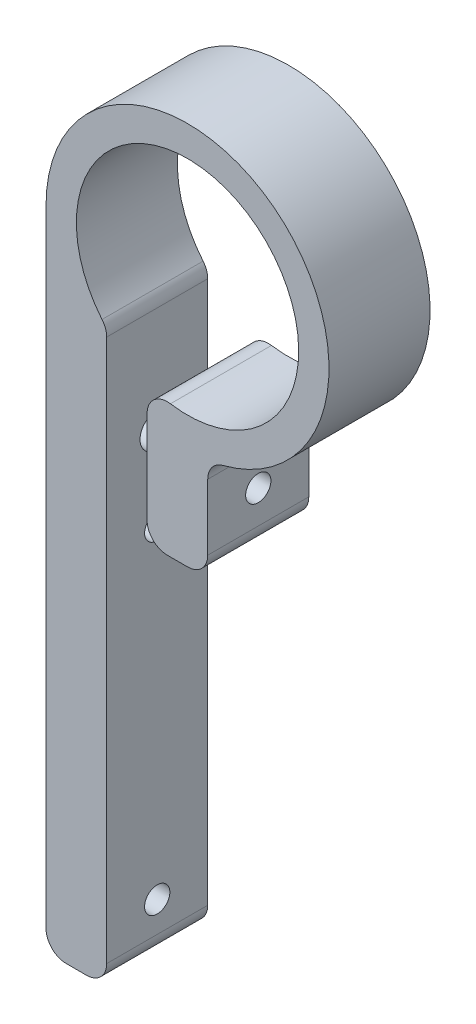
ISO-10303-21;
HEADER;
FILE_DESCRIPTION(('STEP AP214'),'2;1');
FILE_NAME('part.step','',(''),(''),'','','');
FILE_SCHEMA(('AUTOMOTIVE_DESIGN { 1 0 10303 214 1 1 1 1 }'));
ENDSEC;
DATA;
#1=APPLICATION_CONTEXT('core data for automotive mechanical design processes');
#2=APPLICATION_PROTOCOL_DEFINITION('international standard','automotive_design',2000,#1);
#3=PRODUCT_CONTEXT('',#1,'mechanical');
#4=PRODUCT('Part','Part','',(#3));
#5=PRODUCT_RELATED_PRODUCT_CATEGORY('part','',(#4));
#6=PRODUCT_DEFINITION_FORMATION('','',#4);
#7=PRODUCT_DEFINITION_CONTEXT('part definition',#1,'design');
#8=PRODUCT_DEFINITION('design','',#6,#7);
#9=PRODUCT_DEFINITION_SHAPE('','',#8);
#10=(LENGTH_UNIT() NAMED_UNIT(*) SI_UNIT(.MILLI.,.METRE.));
#11=(NAMED_UNIT(*) PLANE_ANGLE_UNIT() SI_UNIT($,.RADIAN.));
#12=(NAMED_UNIT(*) SI_UNIT($,.STERADIAN.) SOLID_ANGLE_UNIT());
#13=UNCERTAINTY_MEASURE_WITH_UNIT(LENGTH_MEASURE(1.E-05),#10,'distance_accuracy_value','');
#14=(GEOMETRIC_REPRESENTATION_CONTEXT(3) GLOBAL_UNCERTAINTY_ASSIGNED_CONTEXT((#13)) GLOBAL_UNIT_ASSIGNED_CONTEXT((#10,
#11,#12)) REPRESENTATION_CONTEXT('',''));
#15=CARTESIAN_POINT('',(0.,0.,0.));
#16=DIRECTION('',(0.,0.,1.));
#17=DIRECTION('',(1.,0.,0.));
#18=AXIS2_PLACEMENT_3D('',#15,#16,#17);
#19=CARTESIAN_POINT('',(0.,0.,10.));
#20=DIRECTION('',(0.,0.,-1.));
#21=DIRECTION('',(-1.,0.,0.));
#22=AXIS2_PLACEMENT_3D('',#19,#20,#21);
#23=CYLINDRICAL_SURFACE('',#22,14.);
#24=CARTESIAN_POINT('',(0.,0.,10.));
#25=DIRECTION('',(0.,0.,1.));
#26=DIRECTION('',(1.,0.,0.));
#27=AXIS2_PLACEMENT_3D('',#24,#25,#26);
#28=CIRCLE('',#27,14.);
#29=CARTESIAN_POINT('',(3.5,-13.555441711726,10.));
#30=VERTEX_POINT('',#29);
#31=CARTESIAN_POINT('',(-14.,0.,10.));
#32=VERTEX_POINT('',#31);
#33=EDGE_CURVE('E148',#30,#32,#28,.T.);
#34=ORIENTED_EDGE('',*,*,#33,.F.);
#35=DIRECTION('',(0.,0.,-1.));
#36=VECTOR('',#35,1.);
#37=CARTESIAN_POINT('',(3.5,-13.555441711726,10.));
#38=LINE('',#37,#36);
#39=CARTESIAN_POINT('',(3.5,-13.555441711726,0.));
#40=VERTEX_POINT('',#39);
#41=EDGE_CURVE('E227',#30,#40,#38,.T.);
#42=ORIENTED_EDGE('',*,*,#41,.T.);
#43=CARTESIAN_POINT('',(0.,0.,0.));
#44=DIRECTION('',(0.,0.,1.));
#45=DIRECTION('',(1.,0.,0.));
#46=AXIS2_PLACEMENT_3D('',#43,#44,#45);
#47=CIRCLE('',#46,14.);
#48=CARTESIAN_POINT('',(-14.,0.,0.));
#49=VERTEX_POINT('',#48);
#50=EDGE_CURVE('E170',#40,#49,#47,.T.);
#51=ORIENTED_EDGE('',*,*,#50,.T.);
#52=DIRECTION('',(0.,0.,-1.));
#53=VECTOR('',#52,1.);
#54=CARTESIAN_POINT('',(-14.,0.,10.));
#55=LINE('',#54,#53);
#56=EDGE_CURVE('E164',#32,#49,#55,.T.);
#57=ORIENTED_EDGE('',*,*,#56,.F.);
#58=EDGE_LOOP('',(#34,#42,#51,#57));
#59=FACE_BOUND('',#58,.T.);
#60=ADVANCED_FACE('F39',(#59),#23,.T.);
#61=CARTESIAN_POINT('',(-14.,0.,10.));
#62=DIRECTION('',(1.,0.,0.));
#63=DIRECTION('',(0.,1.,0.));
#64=AXIS2_PLACEMENT_3D('',#61,#62,#63);
#65=PLANE('',#64);
#66=CARTESIAN_POINT('',(-14.,-27.,5.));
#67=DIRECTION('',(-1.,0.,0.));
#68=DIRECTION('',(0.,0.,1.));
#69=AXIS2_PLACEMENT_3D('',#66,#67,#68);
#70=CIRCLE('',#69,1.24999999999999);
#71=CARTESIAN_POINT('',(-14.,-27.,6.24999999999999));
#72=VERTEX_POINT('',#71);
#73=EDGE_CURVE('E248',#72,#72,#70,.T.);
#74=ORIENTED_EDGE('',*,*,#73,.F.);
#75=EDGE_LOOP('',(#74));
#76=FACE_BOUND('',#75,.T.);
#77=CARTESIAN_POINT('',(-14.,-59.,5.));
#78=DIRECTION('',(-1.,0.,0.));
#79=DIRECTION('',(0.,0.,1.));
#80=AXIS2_PLACEMENT_3D('',#77,#78,#79);
#81=CIRCLE('',#80,1.24999999999999);
#82=CARTESIAN_POINT('',(-14.,-59.,6.24999999999999));
#83=VERTEX_POINT('',#82);
#84=EDGE_CURVE('E237',#83,#83,#81,.T.);
#85=ORIENTED_EDGE('',*,*,#84,.F.);
#86=EDGE_LOOP('',(#85));
#87=FACE_BOUND('',#86,.T.);
#88=CARTESIAN_POINT('',(-14.,-18.7459666924148,5.));
#89=DIRECTION('',(-1.,0.,0.));
#90=DIRECTION('',(0.,0.,1.));
#91=AXIS2_PLACEMENT_3D('',#88,#89,#90);
#92=CIRCLE('',#91,3.25);
#93=CARTESIAN_POINT('',(-14.,-18.7459666924148,8.25));
#94=VERTEX_POINT('',#93);
#95=EDGE_CURVE('E253',#94,#94,#92,.T.);
#96=ORIENTED_EDGE('',*,*,#95,.F.);
#97=EDGE_LOOP('',(#96));
#98=FACE_BOUND('',#97,.T.);
#99=DIRECTION('',(0.,-1.,0.));
#100=VECTOR('',#99,1.);
#101=CARTESIAN_POINT('',(-14.,0.,0.));
#102=LINE('',#101,#100);
#103=CARTESIAN_POINT('',(-14.,-62.,0.));
#104=VERTEX_POINT('',#103);
#105=EDGE_CURVE('E278',#49,#104,#102,.T.);
#106=ORIENTED_EDGE('',*,*,#105,.T.);
#107=DIRECTION('',(0.,0.,-1.));
#108=VECTOR('',#107,1.);
#109=CARTESIAN_POINT('',(-14.,-62.,10.));
#110=LINE('',#109,#108);
#111=CARTESIAN_POINT('',(-14.,-62.,10.));
#112=VERTEX_POINT('',#111);
#113=EDGE_CURVE('E166',#104,#112,#110,.F.);
#114=ORIENTED_EDGE('',*,*,#113,.T.);
#115=DIRECTION('',(0.,-1.,0.));
#116=VECTOR('',#115,1.);
#117=CARTESIAN_POINT('',(-14.,0.,10.));
#118=LINE('',#117,#116);
#119=EDGE_CURVE('E151',#32,#112,#118,.T.);
#120=ORIENTED_EDGE('',*,*,#119,.F.);
#121=ORIENTED_EDGE('',*,*,#56,.T.);
#122=EDGE_LOOP('',(#106,#114,#120,#121));
#123=FACE_BOUND('',#122,.T.);
#124=ADVANCED_FACE('F163',(#76,#87,#98,#123),#65,.F.);
#125=CARTESIAN_POINT('',(-14.,-64.,10.));
#126=DIRECTION('',(0.,1.,0.));
#127=DIRECTION('',(0.,0.,1.));
#128=AXIS2_PLACEMENT_3D('',#125,#126,#127);
#129=PLANE('',#128);
#130=DIRECTION('',(1.,0.,0.));
#131=VECTOR('',#130,1.);
#132=CARTESIAN_POINT('',(-14.,-64.,10.));
#133=LINE('',#132,#131);
#134=CARTESIAN_POINT('',(-12.,-64.,10.));
#135=VERTEX_POINT('',#134);
#136=CARTESIAN_POINT('',(-9.99999999999999,-64.,10.));
#137=VERTEX_POINT('',#136);
#138=EDGE_CURVE('E167',#135,#137,#133,.T.);
#139=ORIENTED_EDGE('',*,*,#138,.F.);
#140=DIRECTION('',(0.,0.,-1.));
#141=VECTOR('',#140,1.);
#142=CARTESIAN_POINT('',(-12.,-64.,10.));
#143=LINE('',#142,#141);
#144=CARTESIAN_POINT('',(-12.,-64.,0.));
#145=VERTEX_POINT('',#144);
#146=EDGE_CURVE('E175',#135,#145,#143,.T.);
#147=ORIENTED_EDGE('',*,*,#146,.T.);
#148=DIRECTION('',(1.,0.,0.));
#149=VECTOR('',#148,1.);
#150=CARTESIAN_POINT('',(-14.,-64.,0.));
#151=LINE('',#150,#149);
#152=CARTESIAN_POINT('',(-9.99999999999999,-64.,0.));
#153=VERTEX_POINT('',#152);
#154=EDGE_CURVE('E280',#145,#153,#151,.T.);
#155=ORIENTED_EDGE('',*,*,#154,.T.);
#156=DIRECTION('',(0.,0.,-1.));
#157=VECTOR('',#156,1.);
#158=CARTESIAN_POINT('',(-9.99999999999999,-64.,10.));
#159=LINE('',#158,#157);
#160=EDGE_CURVE('E172',#153,#137,#159,.F.);
#161=ORIENTED_EDGE('',*,*,#160,.T.);
#162=EDGE_LOOP('',(#139,#147,#155,#161));
#163=FACE_BOUND('',#162,.T.);
#164=ADVANCED_FACE('F310',(#163),#129,.F.);
#165=CARTESIAN_POINT('',(-8.,-7.54983443527075,10.));
#166=DIRECTION('',(-1.,0.,0.));
#167=DIRECTION('',(0.,-1.,0.));
#168=AXIS2_PLACEMENT_3D('',#165,#166,#167);
#169=PLANE('',#168);
#170=CARTESIAN_POINT('',(-8.,-27.,5.));
#171=DIRECTION('',(-1.,0.,0.));
#172=DIRECTION('',(0.,-1.,0.));
#173=AXIS2_PLACEMENT_3D('',#170,#171,#172);
#174=CIRCLE('',#173,1.24999999999999);
#175=CARTESIAN_POINT('',(-8.,-28.25,5.));
#176=VERTEX_POINT('',#175);
#177=EDGE_CURVE('E43',#176,#176,#174,.T.);
#178=ORIENTED_EDGE('',*,*,#177,.T.);
#179=EDGE_LOOP('',(#178));
#180=FACE_BOUND('',#179,.T.);
#181=CARTESIAN_POINT('',(-7.99999999999999,-59.,5.));
#182=DIRECTION('',(-1.,0.,0.));
#183=DIRECTION('',(0.,-1.,0.));
#184=AXIS2_PLACEMENT_3D('',#181,#182,#183);
#185=CIRCLE('',#184,1.24999999999999);
#186=CARTESIAN_POINT('',(-7.99999999999999,-60.25,5.));
#187=VERTEX_POINT('',#186);
#188=EDGE_CURVE('E234',#187,#187,#185,.T.);
#189=ORIENTED_EDGE('',*,*,#188,.T.);
#190=EDGE_LOOP('',(#189));
#191=FACE_BOUND('',#190,.T.);
#192=CARTESIAN_POINT('',(-8.,-18.7459666924148,5.));
#193=DIRECTION('',(-1.,0.,0.));
#194=DIRECTION('',(0.,-1.,0.));
#195=AXIS2_PLACEMENT_3D('',#192,#193,#194);
#196=CIRCLE('',#195,1.7);
#197=CARTESIAN_POINT('',(-8.,-20.4459666924148,5.));
#198=VERTEX_POINT('',#197);
#199=EDGE_CURVE('E262',#198,#198,#196,.T.);
#200=ORIENTED_EDGE('',*,*,#199,.T.);
#201=EDGE_LOOP('',(#200));
#202=FACE_BOUND('',#201,.T.);
#203=DIRECTION('',(0.,1.,0.));
#204=VECTOR('',#203,1.);
#205=CARTESIAN_POINT('',(-8.,-7.54983443527075,10.));
#206=LINE('',#205,#204);
#207=CARTESIAN_POINT('',(-7.99999999999999,-62.,10.));
#208=VERTEX_POINT('',#207);
#209=CARTESIAN_POINT('',(-8.,-8.30662386291808,10.));
#210=VERTEX_POINT('',#209);
#211=EDGE_CURVE('E267',#208,#210,#206,.T.);
#212=ORIENTED_EDGE('',*,*,#211,.F.);
#213=DIRECTION('',(0.,0.,-1.));
#214=VECTOR('',#213,1.);
#215=CARTESIAN_POINT('',(-7.99999999999999,-62.,10.));
#216=LINE('',#215,#214);
#217=CARTESIAN_POINT('',(-7.99999999999999,-62.,0.));
#218=VERTEX_POINT('',#217);
#219=EDGE_CURVE('E210',#208,#218,#216,.T.);
#220=ORIENTED_EDGE('',*,*,#219,.T.);
#221=DIRECTION('',(0.,1.,0.));
#222=VECTOR('',#221,1.);
#223=CARTESIAN_POINT('',(-8.,-7.54983443527075,0.));
#224=LINE('',#223,#222);
#225=CARTESIAN_POINT('',(-8.,-8.30662386291808,0.));
#226=VERTEX_POINT('',#225);
#227=EDGE_CURVE('E283',#218,#226,#224,.T.);
#228=ORIENTED_EDGE('',*,*,#227,.T.);
#229=DIRECTION('',(0.,0.,-1.));
#230=VECTOR('',#229,1.);
#231=CARTESIAN_POINT('',(-8.,-8.30662386291808,10.));
#232=LINE('',#231,#230);
#233=EDGE_CURVE('E208',#226,#210,#232,.F.);
#234=ORIENTED_EDGE('',*,*,#233,.T.);
#235=EDGE_LOOP('',(#212,#220,#228,#234));
#236=FACE_BOUND('',#235,.T.);
#237=ADVANCED_FACE('F318',(#180,#191,#202,#236),#169,.F.);
#238=CARTESIAN_POINT('',(0.,0.,10.));
#239=DIRECTION('',(0.,0.,-1.));
#240=DIRECTION('',(-1.,0.,0.));
#241=AXIS2_PLACEMENT_3D('',#238,#239,#240);
#242=CYLINDRICAL_SURFACE('',#241,11.);
#243=CARTESIAN_POINT('',(0.,0.,0.));
#244=DIRECTION('',(0.,0.,-1.));
#245=DIRECTION('',(1.,0.,0.));
#246=AXIS2_PLACEMENT_3D('',#243,#244,#245);
#247=CIRCLE('',#246,11.);
#248=CARTESIAN_POINT('',(-8.46153846153846,-7.02868173016145,0.));
#249=VERTEX_POINT('',#248);
#250=CARTESIAN_POINT('',(-1.69230769230769,-10.8690429511782,0.));
#251=VERTEX_POINT('',#250);
#252=EDGE_CURVE('E286',#249,#251,#247,.T.);
#253=ORIENTED_EDGE('',*,*,#252,.T.);
#254=DIRECTION('',(0.,0.,-1.));
#255=VECTOR('',#254,1.);
#256=CARTESIAN_POINT('',(-1.69230769230769,-10.8690429511782,10.));
#257=LINE('',#256,#255);
#258=CARTESIAN_POINT('',(-1.69230769230769,-10.8690429511782,10.));
#259=VERTEX_POINT('',#258);
#260=EDGE_CURVE('E232',#251,#259,#257,.F.);
#261=ORIENTED_EDGE('',*,*,#260,.T.);
#262=CARTESIAN_POINT('',(0.,0.,10.));
#263=DIRECTION('',(0.,0.,-1.));
#264=DIRECTION('',(1.,0.,0.));
#265=AXIS2_PLACEMENT_3D('',#262,#263,#264);
#266=CIRCLE('',#265,11.);
#267=CARTESIAN_POINT('',(-8.46153846153846,-7.02868173016145,10.));
#268=VERTEX_POINT('',#267);
#269=EDGE_CURVE('E270',#268,#259,#266,.T.);
#270=ORIENTED_EDGE('',*,*,#269,.F.);
#271=DIRECTION('',(0.,0.,-1.));
#272=VECTOR('',#271,1.);
#273=CARTESIAN_POINT('',(-8.46153846153846,-7.02868173016145,10.));
#274=LINE('',#273,#272);
#275=EDGE_CURVE('E229',#268,#249,#274,.T.);
#276=ORIENTED_EDGE('',*,*,#275,.T.);
#277=EDGE_LOOP('',(#253,#261,#270,#276));
#278=FACE_BOUND('',#277,.T.);
#279=ADVANCED_FACE('F326',(#278),#242,.F.);
#280=CARTESIAN_POINT('',(-4.,-10.2469507659596,10.));
#281=DIRECTION('',(1.,0.,0.));
#282=DIRECTION('',(0.,1.,0.));
#283=AXIS2_PLACEMENT_3D('',#280,#281,#282);
#284=PLANE('',#283);
#285=CARTESIAN_POINT('',(-4.,-18.7459666924148,5.));
#286=DIRECTION('',(-1.,0.,0.));
#287=DIRECTION('',(0.,0.,1.));
#288=AXIS2_PLACEMENT_3D('',#285,#286,#287);
#289=CIRCLE('',#288,1.24999999999999);
#290=CARTESIAN_POINT('',(-4.,-18.7459666924148,6.24999999999999));
#291=VERTEX_POINT('',#290);
#292=EDGE_CURVE('E236',#291,#291,#289,.T.);
#293=ORIENTED_EDGE('',*,*,#292,.F.);
#294=EDGE_LOOP('',(#293));
#295=FACE_BOUND('',#294,.T.);
#296=DIRECTION('',(0.,-1.,0.));
#297=VECTOR('',#296,1.);
#298=CARTESIAN_POINT('',(-4.,-10.2469507659596,0.));
#299=LINE('',#298,#297);
#300=CARTESIAN_POINT('',(-4.,-12.8452325786651,0.));
#301=VERTEX_POINT('',#300);
#302=CARTESIAN_POINT('',(-4.,-22.,0.));
#303=VERTEX_POINT('',#302);
#304=EDGE_CURVE('E289',#301,#303,#299,.T.);
#305=ORIENTED_EDGE('',*,*,#304,.T.);
#306=DIRECTION('',(0.,0.,-1.));
#307=VECTOR('',#306,1.);
#308=CARTESIAN_POINT('',(-4.,-22.,10.));
#309=LINE('',#308,#307);
#310=CARTESIAN_POINT('',(-4.,-22.,10.));
#311=VERTEX_POINT('',#310);
#312=EDGE_CURVE('E221',#303,#311,#309,.F.);
#313=ORIENTED_EDGE('',*,*,#312,.T.);
#314=DIRECTION('',(0.,-1.,0.));
#315=VECTOR('',#314,1.);
#316=CARTESIAN_POINT('',(-4.,-10.2469507659596,10.));
#317=LINE('',#316,#315);
#318=CARTESIAN_POINT('',(-4.,-12.8452325786651,10.));
#319=VERTEX_POINT('',#318);
#320=EDGE_CURVE('E273',#319,#311,#317,.T.);
#321=ORIENTED_EDGE('',*,*,#320,.F.);
#322=DIRECTION('',(0.,0.,-1.));
#323=VECTOR('',#322,1.);
#324=CARTESIAN_POINT('',(-4.,-12.8452325786651,10.));
#325=LINE('',#324,#323);
#326=EDGE_CURVE('E218',#319,#301,#325,.T.);
#327=ORIENTED_EDGE('',*,*,#326,.T.);
#328=EDGE_LOOP('',(#305,#313,#321,#327));
#329=FACE_BOUND('',#328,.T.);
#330=ADVANCED_FACE('F335',(#295,#329),#284,.F.);
#331=CARTESIAN_POINT('',(-4.,-24.,10.));
#332=DIRECTION('',(0.,1.,0.));
#333=DIRECTION('',(0.,0.,1.));
#334=AXIS2_PLACEMENT_3D('',#331,#332,#333);
#335=PLANE('',#334);
#336=DIRECTION('',(1.,0.,0.));
#337=VECTOR('',#336,1.);
#338=CARTESIAN_POINT('',(-4.,-24.,10.));
#339=LINE('',#338,#337);
#340=CARTESIAN_POINT('',(-2.,-24.,10.));
#341=VERTEX_POINT('',#340);
#342=CARTESIAN_POINT('',(0.,-24.,10.));
#343=VERTEX_POINT('',#342);
#344=EDGE_CURVE('E177',#341,#343,#339,.T.);
#345=ORIENTED_EDGE('',*,*,#344,.F.);
#346=DIRECTION('',(0.,0.,-1.));
#347=VECTOR('',#346,1.);
#348=CARTESIAN_POINT('',(-2.,-24.,10.));
#349=LINE('',#348,#347);
#350=CARTESIAN_POINT('',(-2.,-24.,0.));
#351=VERTEX_POINT('',#350);
#352=EDGE_CURVE('E215',#341,#351,#349,.T.);
#353=ORIENTED_EDGE('',*,*,#352,.T.);
#354=DIRECTION('',(1.,0.,0.));
#355=VECTOR('',#354,1.);
#356=CARTESIAN_POINT('',(-4.,-24.,0.));
#357=LINE('',#356,#355);
#358=CARTESIAN_POINT('',(0.,-24.,0.));
#359=VERTEX_POINT('',#358);
#360=EDGE_CURVE('E291',#351,#359,#357,.T.);
#361=ORIENTED_EDGE('',*,*,#360,.T.);
#362=DIRECTION('',(0.,0.,-1.));
#363=VECTOR('',#362,1.);
#364=CARTESIAN_POINT('',(0.,-24.,10.));
#365=LINE('',#364,#363);
#366=EDGE_CURVE('E213',#359,#343,#365,.F.);
#367=ORIENTED_EDGE('',*,*,#366,.T.);
#368=EDGE_LOOP('',(#345,#353,#361,#367));
#369=FACE_BOUND('',#368,.T.);
#370=ADVANCED_FACE('F342',(#369),#335,.F.);
#371=CARTESIAN_POINT('',(2.,-13.856406460551,10.));
#372=DIRECTION('',(-1.,0.,0.));
#373=DIRECTION('',(0.,-1.,0.));
#374=AXIS2_PLACEMENT_3D('',#371,#372,#373);
#375=PLANE('',#374);
#376=CARTESIAN_POINT('',(2.,-18.7459666924148,5.));
#377=DIRECTION('',(-1.,0.,0.));
#378=DIRECTION('',(0.,-1.,0.));
#379=AXIS2_PLACEMENT_3D('',#376,#377,#378);
#380=CIRCLE('',#379,1.24999999999999);
#381=CARTESIAN_POINT('',(2.,-19.9959666924148,5.));
#382=VERTEX_POINT('',#381);
#383=EDGE_CURVE('E241',#382,#382,#380,.T.);
#384=ORIENTED_EDGE('',*,*,#383,.T.);
#385=EDGE_LOOP('',(#384));
#386=FACE_BOUND('',#385,.T.);
#387=DIRECTION('',(0.,1.,0.));
#388=VECTOR('',#387,1.);
#389=CARTESIAN_POINT('',(2.,-13.856406460551,10.));
#390=LINE('',#389,#388);
#391=CARTESIAN_POINT('',(2.,-22.,10.));
#392=VERTEX_POINT('',#391);
#393=CARTESIAN_POINT('',(2.,-15.4919333848297,10.));
#394=VERTEX_POINT('',#393);
#395=EDGE_CURVE('E173',#392,#394,#390,.T.);
#396=ORIENTED_EDGE('',*,*,#395,.F.);
#397=DIRECTION('',(0.,0.,-1.));
#398=VECTOR('',#397,1.);
#399=CARTESIAN_POINT('',(2.,-22.,10.));
#400=LINE('',#399,#398);
#401=CARTESIAN_POINT('',(2.,-22.,0.));
#402=VERTEX_POINT('',#401);
#403=EDGE_CURVE('E224',#392,#402,#400,.T.);
#404=ORIENTED_EDGE('',*,*,#403,.T.);
#405=DIRECTION('',(0.,1.,0.));
#406=VECTOR('',#405,1.);
#407=CARTESIAN_POINT('',(2.,-13.856406460551,0.));
#408=LINE('',#407,#406);
#409=CARTESIAN_POINT('',(2.,-15.4919333848297,0.));
#410=VERTEX_POINT('',#409);
#411=EDGE_CURVE('E158',#402,#410,#408,.T.);
#412=ORIENTED_EDGE('',*,*,#411,.T.);
#413=DIRECTION('',(0.,0.,1.));
#414=VECTOR('',#413,1.);
#415=CARTESIAN_POINT('',(2.,-15.4919333848297,10.));
#416=LINE('',#415,#414);
#417=EDGE_CURVE('E56',#410,#394,#416,.T.);
#418=ORIENTED_EDGE('',*,*,#417,.T.);
#419=EDGE_LOOP('',(#396,#404,#412,#418));
#420=FACE_BOUND('',#419,.T.);
#421=ADVANCED_FACE('F297',(#386,#420),#375,.F.);
#422=CARTESIAN_POINT('',(0.,0.,10.));
#423=DIRECTION('',(0.,0.,1.));
#424=DIRECTION('',(1.,0.,0.));
#425=AXIS2_PLACEMENT_3D('',#422,#423,#424);
#426=PLANE('',#425);
#427=ORIENTED_EDGE('',*,*,#119,.T.);
#428=CARTESIAN_POINT('',(-12.,-62.,10.));
#429=DIRECTION('',(0.,0.,1.));
#430=DIRECTION('',(1.,0.,0.));
#431=AXIS2_PLACEMENT_3D('',#428,#429,#430);
#432=CIRCLE('',#431,2.);
#433=EDGE_CURVE('E206',#112,#135,#432,.T.);
#434=ORIENTED_EDGE('',*,*,#433,.T.);
#435=ORIENTED_EDGE('',*,*,#138,.T.);
#436=CARTESIAN_POINT('',(-9.99999999999999,-62.,10.));
#437=DIRECTION('',(0.,0.,1.));
#438=DIRECTION('',(1.,0.,0.));
#439=AXIS2_PLACEMENT_3D('',#436,#437,#438);
#440=CIRCLE('',#439,2.);
#441=EDGE_CURVE('E204',#137,#208,#440,.T.);
#442=ORIENTED_EDGE('',*,*,#441,.T.);
#443=ORIENTED_EDGE('',*,*,#211,.T.);
#444=CARTESIAN_POINT('',(-10.,-8.30662386291808,10.));
#445=DIRECTION('',(0.,0.,1.));
#446=DIRECTION('',(1.,0.,0.));
#447=AXIS2_PLACEMENT_3D('',#444,#445,#446);
#448=CIRCLE('',#447,2.);
#449=EDGE_CURVE('E197',#210,#268,#448,.T.);
#450=ORIENTED_EDGE('',*,*,#449,.T.);
#451=ORIENTED_EDGE('',*,*,#269,.T.);
#452=CARTESIAN_POINT('',(-2.,-12.8452325786651,10.));
#453=DIRECTION('',(0.,0.,1.));
#454=DIRECTION('',(1.,0.,0.));
#455=AXIS2_PLACEMENT_3D('',#452,#453,#454);
#456=CIRCLE('',#455,2.);
#457=EDGE_CURVE('E199',#259,#319,#456,.T.);
#458=ORIENTED_EDGE('',*,*,#457,.T.);
#459=ORIENTED_EDGE('',*,*,#320,.T.);
#460=CARTESIAN_POINT('',(-2.,-22.,10.));
#461=DIRECTION('',(0.,0.,1.));
#462=DIRECTION('',(1.,0.,0.));
#463=AXIS2_PLACEMENT_3D('',#460,#461,#462);
#464=CIRCLE('',#463,2.);
#465=EDGE_CURVE('E202',#311,#341,#464,.T.);
#466=ORIENTED_EDGE('',*,*,#465,.T.);
#467=ORIENTED_EDGE('',*,*,#344,.T.);
#468=CARTESIAN_POINT('',(0.,-22.,10.));
#469=DIRECTION('',(0.,0.,1.));
#470=DIRECTION('',(1.,0.,0.));
#471=AXIS2_PLACEMENT_3D('',#468,#469,#470);
#472=CIRCLE('',#471,2.);
#473=EDGE_CURVE('E63',#343,#392,#472,.T.);
#474=ORIENTED_EDGE('',*,*,#473,.T.);
#475=ORIENTED_EDGE('',*,*,#395,.T.);
#476=CARTESIAN_POINT('',(4.,-15.4919333848297,10.));
#477=DIRECTION('',(0.,0.,1.));
#478=DIRECTION('',(1.,0.,0.));
#479=AXIS2_PLACEMENT_3D('',#476,#477,#478);
#480=CIRCLE('',#479,2.);
#481=EDGE_CURVE('E11',#394,#30,#480,.F.);
#482=ORIENTED_EDGE('',*,*,#481,.T.);
#483=ORIENTED_EDGE('',*,*,#33,.T.);
#484=EDGE_LOOP('',(#427,#434,#435,#442,#443,#450,#451,#458,#459,#466,#467,#474,#475,#482,#483));
#485=FACE_BOUND('',#484,.T.);
#486=ADVANCED_FACE('F150',(#485),#426,.T.);
#487=CARTESIAN_POINT('',(0.,0.,0.));
#488=DIRECTION('',(0.,0.,1.));
#489=DIRECTION('',(1.,0.,0.));
#490=AXIS2_PLACEMENT_3D('',#487,#488,#489);
#491=PLANE('',#490);
#492=ORIENTED_EDGE('',*,*,#154,.F.);
#493=CARTESIAN_POINT('',(-12.,-62.,0.));
#494=DIRECTION('',(0.,0.,1.));
#495=DIRECTION('',(1.,0.,0.));
#496=AXIS2_PLACEMENT_3D('',#493,#494,#495);
#497=CIRCLE('',#496,2.);
#498=EDGE_CURVE('E194',#145,#104,#497,.F.);
#499=ORIENTED_EDGE('',*,*,#498,.T.);
#500=ORIENTED_EDGE('',*,*,#105,.F.);
#501=ORIENTED_EDGE('',*,*,#50,.F.);
#502=CARTESIAN_POINT('',(4.,-15.4919333848297,0.));
#503=DIRECTION('',(0.,0.,1.));
#504=DIRECTION('',(1.,0.,0.));
#505=AXIS2_PLACEMENT_3D('',#502,#503,#504);
#506=CIRCLE('',#505,2.);
#507=EDGE_CURVE('E48',#40,#410,#506,.T.);
#508=ORIENTED_EDGE('',*,*,#507,.T.);
#509=ORIENTED_EDGE('',*,*,#411,.F.);
#510=CARTESIAN_POINT('',(0.,-22.,0.));
#511=DIRECTION('',(0.,0.,1.));
#512=DIRECTION('',(1.,0.,0.));
#513=AXIS2_PLACEMENT_3D('',#510,#511,#512);
#514=CIRCLE('',#513,2.);
#515=EDGE_CURVE('E188',#402,#359,#514,.F.);
#516=ORIENTED_EDGE('',*,*,#515,.T.);
#517=ORIENTED_EDGE('',*,*,#360,.F.);
#518=CARTESIAN_POINT('',(-2.,-22.,0.));
#519=DIRECTION('',(0.,0.,1.));
#520=DIRECTION('',(1.,0.,0.));
#521=AXIS2_PLACEMENT_3D('',#518,#519,#520);
#522=CIRCLE('',#521,2.);
#523=EDGE_CURVE('E190',#351,#303,#522,.F.);
#524=ORIENTED_EDGE('',*,*,#523,.T.);
#525=ORIENTED_EDGE('',*,*,#304,.F.);
#526=CARTESIAN_POINT('',(-2.,-12.8452325786651,0.));
#527=DIRECTION('',(0.,0.,1.));
#528=DIRECTION('',(1.,0.,0.));
#529=AXIS2_PLACEMENT_3D('',#526,#527,#528);
#530=CIRCLE('',#529,2.);
#531=EDGE_CURVE('E186',#301,#251,#530,.F.);
#532=ORIENTED_EDGE('',*,*,#531,.T.);
#533=ORIENTED_EDGE('',*,*,#252,.F.);
#534=CARTESIAN_POINT('',(-10.,-8.30662386291808,0.));
#535=DIRECTION('',(0.,0.,1.));
#536=DIRECTION('',(1.,0.,0.));
#537=AXIS2_PLACEMENT_3D('',#534,#535,#536);
#538=CIRCLE('',#537,2.);
#539=EDGE_CURVE('E184',#249,#226,#538,.F.);
#540=ORIENTED_EDGE('',*,*,#539,.T.);
#541=ORIENTED_EDGE('',*,*,#227,.F.);
#542=CARTESIAN_POINT('',(-9.99999999999999,-62.,0.));
#543=DIRECTION('',(0.,0.,1.));
#544=DIRECTION('',(1.,0.,0.));
#545=AXIS2_PLACEMENT_3D('',#542,#543,#544);
#546=CIRCLE('',#545,2.);
#547=EDGE_CURVE('E192',#218,#153,#546,.F.);
#548=ORIENTED_EDGE('',*,*,#547,.T.);
#549=EDGE_LOOP('',(#492,#499,#500,#501,#508,#509,#516,#517,#524,#525,#532,#533,#540,#541,#548));
#550=FACE_BOUND('',#549,.T.);
#551=ADVANCED_FACE('F303',(#550),#491,.F.);
#552=CARTESIAN_POINT('',(-12.,-62.,10.));
#553=DIRECTION('',(0.,0.,-1.));
#554=DIRECTION('',(-1.,0.,0.));
#555=AXIS2_PLACEMENT_3D('',#552,#553,#554);
#556=CYLINDRICAL_SURFACE('',#555,2.);
#557=ORIENTED_EDGE('',*,*,#433,.F.);
#558=ORIENTED_EDGE('',*,*,#113,.F.);
#559=ORIENTED_EDGE('',*,*,#498,.F.);
#560=ORIENTED_EDGE('',*,*,#146,.F.);
#561=EDGE_LOOP('',(#557,#558,#559,#560));
#562=FACE_BOUND('',#561,.T.);
#563=ADVANCED_FACE('F305',(#562),#556,.T.);
#564=CARTESIAN_POINT('',(-9.99999999999999,-62.,10.));
#565=DIRECTION('',(0.,0.,-1.));
#566=DIRECTION('',(-1.,0.,0.));
#567=AXIS2_PLACEMENT_3D('',#564,#565,#566);
#568=CYLINDRICAL_SURFACE('',#567,2.);
#569=ORIENTED_EDGE('',*,*,#441,.F.);
#570=ORIENTED_EDGE('',*,*,#160,.F.);
#571=ORIENTED_EDGE('',*,*,#547,.F.);
#572=ORIENTED_EDGE('',*,*,#219,.F.);
#573=EDGE_LOOP('',(#569,#570,#571,#572));
#574=FACE_BOUND('',#573,.T.);
#575=ADVANCED_FACE('F313',(#574),#568,.T.);
#576=CARTESIAN_POINT('',(-2.,-22.,10.));
#577=DIRECTION('',(0.,0.,-1.));
#578=DIRECTION('',(-1.,0.,0.));
#579=AXIS2_PLACEMENT_3D('',#576,#577,#578);
#580=CYLINDRICAL_SURFACE('',#579,2.);
#581=ORIENTED_EDGE('',*,*,#465,.F.);
#582=ORIENTED_EDGE('',*,*,#312,.F.);
#583=ORIENTED_EDGE('',*,*,#523,.F.);
#584=ORIENTED_EDGE('',*,*,#352,.F.);
#585=EDGE_LOOP('',(#581,#582,#583,#584));
#586=FACE_BOUND('',#585,.T.);
#587=ADVANCED_FACE('F339',(#586),#580,.T.);
#588=CARTESIAN_POINT('',(0.,-22.,10.));
#589=DIRECTION('',(0.,0.,-1.));
#590=DIRECTION('',(-1.,0.,0.));
#591=AXIS2_PLACEMENT_3D('',#588,#589,#590);
#592=CYLINDRICAL_SURFACE('',#591,2.);
#593=ORIENTED_EDGE('',*,*,#473,.F.);
#594=ORIENTED_EDGE('',*,*,#366,.F.);
#595=ORIENTED_EDGE('',*,*,#515,.F.);
#596=ORIENTED_EDGE('',*,*,#403,.F.);
#597=EDGE_LOOP('',(#593,#594,#595,#596));
#598=FACE_BOUND('',#597,.T.);
#599=ADVANCED_FACE('F344',(#598),#592,.T.);
#600=CARTESIAN_POINT('',(4.,-15.4919333848297,10.));
#601=DIRECTION('',(0.,0.,-1.));
#602=DIRECTION('',(-1.,0.,0.));
#603=AXIS2_PLACEMENT_3D('',#600,#601,#602);
#604=CYLINDRICAL_SURFACE('',#603,2.);
#605=ORIENTED_EDGE('',*,*,#481,.F.);
#606=ORIENTED_EDGE('',*,*,#417,.F.);
#607=ORIENTED_EDGE('',*,*,#507,.F.);
#608=ORIENTED_EDGE('',*,*,#41,.F.);
#609=EDGE_LOOP('',(#605,#606,#607,#608));
#610=FACE_BOUND('',#609,.T.);
#611=ADVANCED_FACE('F301',(#610),#604,.F.);
#612=CARTESIAN_POINT('',(-2.,-12.8452325786651,10.));
#613=DIRECTION('',(0.,0.,-1.));
#614=DIRECTION('',(-1.,0.,0.));
#615=AXIS2_PLACEMENT_3D('',#612,#613,#614);
#616=CYLINDRICAL_SURFACE('',#615,2.);
#617=ORIENTED_EDGE('',*,*,#457,.F.);
#618=ORIENTED_EDGE('',*,*,#260,.F.);
#619=ORIENTED_EDGE('',*,*,#531,.F.);
#620=ORIENTED_EDGE('',*,*,#326,.F.);
#621=EDGE_LOOP('',(#617,#618,#619,#620));
#622=FACE_BOUND('',#621,.T.);
#623=ADVANCED_FACE('F330',(#622),#616,.T.);
#624=CARTESIAN_POINT('',(-10.,-8.30662386291808,10.));
#625=DIRECTION('',(0.,0.,-1.));
#626=DIRECTION('',(-1.,0.,0.));
#627=AXIS2_PLACEMENT_3D('',#624,#625,#626);
#628=CYLINDRICAL_SURFACE('',#627,2.);
#629=ORIENTED_EDGE('',*,*,#449,.F.);
#630=ORIENTED_EDGE('',*,*,#233,.F.);
#631=ORIENTED_EDGE('',*,*,#539,.F.);
#632=ORIENTED_EDGE('',*,*,#275,.F.);
#633=EDGE_LOOP('',(#629,#630,#631,#632));
#634=FACE_BOUND('',#633,.T.);
#635=ADVANCED_FACE('F41',(#634),#628,.T.);
#636=CARTESIAN_POINT('',(-14.,-18.7459666924148,5.));
#637=DIRECTION('',(-1.,0.,0.));
#638=DIRECTION('',(0.,0.,1.));
#639=AXIS2_PLACEMENT_3D('',#636,#637,#638);
#640=CYLINDRICAL_SURFACE('',#639,1.7);
#641=ORIENTED_EDGE('',*,*,#199,.F.);
#642=EDGE_LOOP('',(#641));
#643=FACE_BOUND('',#642,.T.);
#644=CARTESIAN_POINT('',(-11.,-18.7459666924148,5.));
#645=DIRECTION('',(-1.,0.,0.));
#646=DIRECTION('',(0.,0.,1.));
#647=AXIS2_PLACEMENT_3D('',#644,#645,#646);
#648=CIRCLE('',#647,1.7);
#649=CARTESIAN_POINT('',(-11.,-18.7459666924148,6.7));
#650=VERTEX_POINT('',#649);
#651=EDGE_CURVE('E259',#650,#650,#648,.T.);
#652=ORIENTED_EDGE('',*,*,#651,.T.);
#653=EDGE_LOOP('',(#652));
#654=FACE_BOUND('',#653,.T.);
#655=ADVANCED_FACE('F400',(#643,#654),#640,.F.);
#656=CARTESIAN_POINT('',(-11.,-17.0459666924148,5.));
#657=DIRECTION('',(1.,0.,0.));
#658=DIRECTION('',(0.,0.,-1.));
#659=AXIS2_PLACEMENT_3D('',#656,#657,#658);
#660=PLANE('',#659);
#661=ORIENTED_EDGE('',*,*,#651,.F.);
#662=EDGE_LOOP('',(#661));
#663=FACE_BOUND('',#662,.T.);
#664=CARTESIAN_POINT('',(-11.,-18.7459666924148,5.));
#665=DIRECTION('',(-1.,0.,0.));
#666=DIRECTION('',(0.,0.,1.));
#667=AXIS2_PLACEMENT_3D('',#664,#665,#666);
#668=CIRCLE('',#667,3.25);
#669=CARTESIAN_POINT('',(-11.,-18.7459666924148,8.25));
#670=VERTEX_POINT('',#669);
#671=EDGE_CURVE('E256',#670,#670,#668,.T.);
#672=ORIENTED_EDGE('',*,*,#671,.T.);
#673=EDGE_LOOP('',(#672));
#674=FACE_BOUND('',#673,.T.);
#675=ADVANCED_FACE('F408',(#663,#674),#660,.F.);
#676=CARTESIAN_POINT('',(-14.,-18.7459666924148,5.));
#677=DIRECTION('',(-1.,0.,0.));
#678=DIRECTION('',(0.,0.,1.));
#679=AXIS2_PLACEMENT_3D('',#676,#677,#678);
#680=CYLINDRICAL_SURFACE('',#679,3.25);
#681=ORIENTED_EDGE('',*,*,#671,.F.);
#682=EDGE_LOOP('',(#681));
#683=FACE_BOUND('',#682,.T.);
#684=ORIENTED_EDGE('',*,*,#95,.T.);
#685=EDGE_LOOP('',(#684));
#686=FACE_BOUND('',#685,.T.);
#687=ADVANCED_FACE('F418',(#683,#686),#680,.F.);
#688=CARTESIAN_POINT('',(-4.,-18.7459666924148,5.));
#689=DIRECTION('',(-1.,0.,0.));
#690=DIRECTION('',(0.,0.,1.));
#691=AXIS2_PLACEMENT_3D('',#688,#689,#690);
#692=CYLINDRICAL_SURFACE('',#691,1.24999999999999);
#693=ORIENTED_EDGE('',*,*,#383,.F.);
#694=EDGE_LOOP('',(#693));
#695=FACE_BOUND('',#694,.T.);
#696=ORIENTED_EDGE('',*,*,#292,.T.);
#697=EDGE_LOOP('',(#696));
#698=FACE_BOUND('',#697,.T.);
#699=ADVANCED_FACE('F428',(#695,#698),#692,.F.);
#700=CARTESIAN_POINT('',(-14.,-59.,5.));
#701=DIRECTION('',(-1.,0.,0.));
#702=DIRECTION('',(0.,0.,1.));
#703=AXIS2_PLACEMENT_3D('',#700,#701,#702);
#704=CYLINDRICAL_SURFACE('',#703,1.24999999999999);
#705=ORIENTED_EDGE('',*,*,#84,.T.);
#706=EDGE_LOOP('',(#705));
#707=FACE_BOUND('',#706,.T.);
#708=ORIENTED_EDGE('',*,*,#188,.F.);
#709=EDGE_LOOP('',(#708));
#710=FACE_BOUND('',#709,.T.);
#711=ADVANCED_FACE('F463',(#707,#710),#704,.F.);
#712=CARTESIAN_POINT('',(-14.,-27.,5.));
#713=DIRECTION('',(-1.,0.,0.));
#714=DIRECTION('',(0.,0.,1.));
#715=AXIS2_PLACEMENT_3D('',#712,#713,#714);
#716=CYLINDRICAL_SURFACE('',#715,1.24999999999999);
#717=ORIENTED_EDGE('',*,*,#73,.T.);
#718=EDGE_LOOP('',(#717));
#719=FACE_BOUND('',#718,.T.);
#720=ORIENTED_EDGE('',*,*,#177,.F.);
#721=EDGE_LOOP('',(#720));
#722=FACE_BOUND('',#721,.T.);
#723=ADVANCED_FACE('F493',(#719,#722),#716,.F.);
#724=CLOSED_SHELL('',(#60,#124,#164,#237,#279,#330,#370,#421,#486,#551,#563,#575,#587,#599,#611,
#623,#635,#655,#675,#687,#699,#711,#723));
#725=MANIFOLD_SOLID_BREP('B2',#724);
#726=ADVANCED_BREP_SHAPE_REPRESENTATION('',(#18,#725),#14);
#727=SHAPE_DEFINITION_REPRESENTATION(#9,#726);
ENDSEC;
END-ISO-10303-21;
